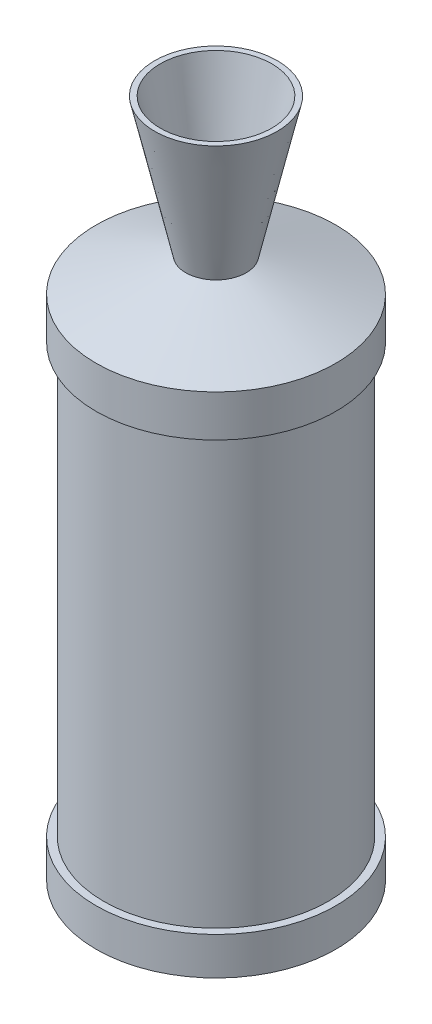
ISO-10303-21;
HEADER;
FILE_DESCRIPTION(('STEP AP214'),'2;1');
FILE_NAME('part.step','',(''),(''),'','','');
FILE_SCHEMA(('AUTOMOTIVE_DESIGN { 1 0 10303 214 1 1 1 1 }'));
ENDSEC;
DATA;
#1=APPLICATION_CONTEXT('core data for automotive mechanical design processes');
#2=APPLICATION_PROTOCOL_DEFINITION('international standard','automotive_design',2000,#1);
#3=PRODUCT_CONTEXT('',#1,'mechanical');
#4=PRODUCT('Part','Part','',(#3));
#5=PRODUCT_RELATED_PRODUCT_CATEGORY('part','',(#4));
#6=PRODUCT_DEFINITION_FORMATION('','',#4);
#7=PRODUCT_DEFINITION_CONTEXT('part definition',#1,'design');
#8=PRODUCT_DEFINITION('design','',#6,#7);
#9=PRODUCT_DEFINITION_SHAPE('','',#8);
#10=(LENGTH_UNIT() NAMED_UNIT(*) SI_UNIT(.MILLI.,.METRE.));
#11=(NAMED_UNIT(*) PLANE_ANGLE_UNIT() SI_UNIT($,.RADIAN.));
#12=(NAMED_UNIT(*) SI_UNIT($,.STERADIAN.) SOLID_ANGLE_UNIT());
#13=UNCERTAINTY_MEASURE_WITH_UNIT(LENGTH_MEASURE(1.E-05),#10,'distance_accuracy_value','');
#14=(GEOMETRIC_REPRESENTATION_CONTEXT(3) GLOBAL_UNCERTAINTY_ASSIGNED_CONTEXT((#13)) GLOBAL_UNIT_ASSIGNED_CONTEXT((#10,
#11,#12)) REPRESENTATION_CONTEXT('',''));
#15=CARTESIAN_POINT('',(0.,0.,0.));
#16=DIRECTION('',(0.,0.,1.));
#17=DIRECTION('',(1.,0.,0.));
#18=AXIS2_PLACEMENT_3D('',#15,#16,#17);
#19=CARTESIAN_POINT('',(0.,0.,0.));
#20=DIRECTION('',(0.,-1.,0.));
#21=DIRECTION('',(0.,0.,-1.));
#22=AXIS2_PLACEMENT_3D('',#19,#20,#21);
#23=CYLINDRICAL_SURFACE('',#22,6.35);
#24=CARTESIAN_POINT('',(0.,12.7,0.));
#25=DIRECTION('',(0.,-1.,0.));
#26=DIRECTION('',(0.,0.,-1.));
#27=AXIS2_PLACEMENT_3D('',#24,#25,#26);
#28=CIRCLE('',#27,6.35);
#29=CARTESIAN_POINT('',(0.,12.7,-6.35));
#30=VERTEX_POINT('',#29);
#31=EDGE_CURVE('E50',#30,#30,#28,.T.);
#32=ORIENTED_EDGE('',*,*,#31,.T.);
#33=EDGE_LOOP('',(#32));
#34=FACE_BOUND('',#33,.T.);
#35=CARTESIAN_POINT('',(0.,508.,0.));
#36=DIRECTION('',(0.,-1.,0.));
#37=DIRECTION('',(0.,0.,-1.));
#38=AXIS2_PLACEMENT_3D('',#35,#36,#37);
#39=CIRCLE('',#38,6.35);
#40=CARTESIAN_POINT('',(0.,508.,-6.35));
#41=VERTEX_POINT('',#40);
#42=EDGE_CURVE('E11',#41,#41,#39,.T.);
#43=ORIENTED_EDGE('',*,*,#42,.F.);
#44=EDGE_LOOP('',(#43));
#45=FACE_BOUND('',#44,.T.);
#46=ADVANCED_FACE('F36',(#34,#45),#23,.F.);
#47=CARTESIAN_POINT('',(0.,491.600448223911,0.));
#48=DIRECTION('',(0.,-1.,0.));
#49=DIRECTION('',(0.,0.,-1.));
#50=AXIS2_PLACEMENT_3D('',#47,#48,#49);
#51=CONICAL_SURFACE('',#50,95.3570367405145,1.38858978130618);
#52=ORIENTED_EDGE('',*,*,#42,.T.);
#53=EDGE_LOOP('',(#52));
#54=FACE_BOUND('',#53,.T.);
#55=CARTESIAN_POINT('',(0.,491.600448223911,0.));
#56=DIRECTION('',(0.,-1.,0.));
#57=DIRECTION('',(0.,0.,-1.));
#58=AXIS2_PLACEMENT_3D('',#55,#56,#57);
#59=CIRCLE('',#58,95.3570367405145);
#60=CARTESIAN_POINT('',(0.,491.600448223911,-95.3570367405145));
#61=VERTEX_POINT('',#60);
#62=EDGE_CURVE('E42',#61,#61,#59,.T.);
#63=ORIENTED_EDGE('',*,*,#62,.F.);
#64=EDGE_LOOP('',(#63));
#65=FACE_BOUND('',#64,.T.);
#66=ADVANCED_FACE('F66',(#54,#65),#51,.T.);
#67=CARTESIAN_POINT('',(0.,0.,0.));
#68=DIRECTION('',(0.,-1.,0.));
#69=DIRECTION('',(0.,0.,-1.));
#70=AXIS2_PLACEMENT_3D('',#67,#68,#69);
#71=CYLINDRICAL_SURFACE('',#70,95.3570367405145);
#72=ORIENTED_EDGE('',*,*,#62,.T.);
#73=EDGE_LOOP('',(#72));
#74=FACE_BOUND('',#73,.T.);
#75=CARTESIAN_POINT('',(0.,42.6531167765359,0.));
#76=DIRECTION('',(0.,-1.,0.));
#77=DIRECTION('',(0.,0.,-1.));
#78=AXIS2_PLACEMENT_3D('',#75,#76,#77);
#79=CIRCLE('',#78,95.3570367405145);
#80=CARTESIAN_POINT('',(0.,42.6531167765359,-95.3570367405145));
#81=VERTEX_POINT('',#80);
#82=EDGE_CURVE('E46',#81,#81,#79,.T.);
#83=ORIENTED_EDGE('',*,*,#82,.F.);
#84=EDGE_LOOP('',(#83));
#85=FACE_BOUND('',#84,.T.);
#86=ADVANCED_FACE('F60',(#74,#85),#71,.T.);
#87=CARTESIAN_POINT('',(0.,12.7,0.));
#88=DIRECTION('',(0.,1.,0.));
#89=DIRECTION('',(0.,0.,1.));
#90=AXIS2_PLACEMENT_3D('',#87,#88,#89);
#91=CONICAL_SURFACE('',#90,6.35,1.24617578850237);
#92=ORIENTED_EDGE('',*,*,#82,.T.);
#93=EDGE_LOOP('',(#92));
#94=FACE_BOUND('',#93,.T.);
#95=ORIENTED_EDGE('',*,*,#31,.F.);
#96=EDGE_LOOP('',(#95));
#97=FACE_BOUND('',#96,.T.);
#98=ADVANCED_FACE('F58',(#94,#97),#91,.T.);
#99=CLOSED_SHELL('',(#46,#66,#86,#98));
#100=MANIFOLD_SOLID_BREP('B2',#99);
#101=CARTESIAN_POINT('',(0.,4.,0.));
#102=DIRECTION('',(0.,1.,0.));
#103=DIRECTION('',(0.,0.,1.));
#104=AXIS2_PLACEMENT_3D('',#101,#102,#103);
#105=PLANE('',#104);
#106=CARTESIAN_POINT('',(0.,4.,0.));
#107=DIRECTION('',(0.,-1.,0.));
#108=DIRECTION('',(0.,0.,-1.));
#109=AXIS2_PLACEMENT_3D('',#106,#107,#108);
#110=CIRCLE('',#109,19.);
#111=CARTESIAN_POINT('',(0.,4.,-19.));
#112=VERTEX_POINT('',#111);
#113=EDGE_CURVE('E35',#112,#112,#110,.T.);
#114=ORIENTED_EDGE('',*,*,#113,.F.);
#115=EDGE_LOOP('',(#114));
#116=FACE_BOUND('',#115,.T.);
#117=ADVANCED_FACE('F97',(#116),#105,.T.);
#118=CARTESIAN_POINT('',(0.,34.44,0.));
#119=DIRECTION('',(0.,1.,0.));
#120=DIRECTION('',(0.,0.,1.));
#121=AXIS2_PLACEMENT_3D('',#118,#119,#120);
#122=CONICAL_SURFACE('',#121,98.37,1.20457687651813);
#123=ORIENTED_EDGE('',*,*,#113,.T.);
#124=EDGE_LOOP('',(#123));
#125=FACE_BOUND('',#124,.T.);
#126=CARTESIAN_POINT('',(0.,34.44,0.));
#127=DIRECTION('',(0.,-1.,0.));
#128=DIRECTION('',(0.,0.,-1.));
#129=AXIS2_PLACEMENT_3D('',#126,#127,#128);
#130=CIRCLE('',#129,98.37);
#131=CARTESIAN_POINT('',(0.,34.44,-98.37));
#132=VERTEX_POINT('',#131);
#133=EDGE_CURVE('E103',#132,#132,#130,.T.);
#134=ORIENTED_EDGE('',*,*,#133,.F.);
#135=EDGE_LOOP('',(#134));
#136=FACE_BOUND('',#135,.T.);
#137=ADVANCED_FACE('F175',(#125,#136),#122,.F.);
#138=CARTESIAN_POINT('',(0.,0.,0.));
#139=DIRECTION('',(0.,-1.,0.));
#140=DIRECTION('',(0.,0.,-1.));
#141=AXIS2_PLACEMENT_3D('',#138,#139,#140);
#142=CYLINDRICAL_SURFACE('',#141,98.37);
#143=ORIENTED_EDGE('',*,*,#133,.T.);
#144=EDGE_LOOP('',(#143));
#145=FACE_BOUND('',#144,.T.);
#146=CARTESIAN_POINT('',(0.,497.22,0.));
#147=DIRECTION('',(0.,-1.,0.));
#148=DIRECTION('',(0.,0.,-1.));
#149=AXIS2_PLACEMENT_3D('',#146,#147,#148);
#150=CIRCLE('',#149,98.37);
#151=CARTESIAN_POINT('',(0.,497.22,-98.37));
#152=VERTEX_POINT('',#151);
#153=EDGE_CURVE('E107',#152,#152,#150,.T.);
#154=ORIENTED_EDGE('',*,*,#153,.F.);
#155=EDGE_LOOP('',(#154));
#156=FACE_BOUND('',#155,.T.);
#157=ADVANCED_FACE('F180',(#145,#156),#142,.F.);
#158=CARTESIAN_POINT('',(0.,508.928258206574,0.));
#159=DIRECTION('',(0.,-1.,0.));
#160=DIRECTION('',(0.,0.,-1.));
#161=AXIS2_PLACEMENT_3D('',#158,#159,#160);
#162=CONICAL_SURFACE('',#161,67.0115032597108,1.21345724627848);
#163=ORIENTED_EDGE('',*,*,#153,.T.);
#164=EDGE_LOOP('',(#163));
#165=FACE_BOUND('',#164,.T.);
#166=CARTESIAN_POINT('',(0.,508.928258206574,0.));
#167=DIRECTION('',(0.,-1.,0.));
#168=DIRECTION('',(0.,0.,-1.));
#169=AXIS2_PLACEMENT_3D('',#166,#167,#168);
#170=CIRCLE('',#169,67.0115032597108);
#171=CARTESIAN_POINT('',(0.,508.928258206574,-67.0115032597108));
#172=VERTEX_POINT('',#171);
#173=EDGE_CURVE('E111',#172,#172,#170,.T.);
#174=ORIENTED_EDGE('',*,*,#173,.F.);
#175=EDGE_LOOP('',(#174));
#176=FACE_BOUND('',#175,.T.);
#177=ADVANCED_FACE('F184',(#165,#176),#162,.F.);
#178=CARTESIAN_POINT('',(0.,471.703452731778,0.));
#179=DIRECTION('',(0.,-1.,0.));
#180=DIRECTION('',(0.,0.,-1.));
#181=AXIS2_PLACEMENT_3D('',#178,#179,#180);
#182=TOROIDAL_SURFACE('',#181,52.3720409279304,40.);
#183=ORIENTED_EDGE('',*,*,#173,.T.);
#184=EDGE_LOOP('',(#183));
#185=FACE_BOUND('',#184,.T.);
#186=CARTESIAN_POINT('',(0.,509.121150910593,0.));
#187=DIRECTION('',(0.,-1.,0.));
#188=DIRECTION('',(0.,0.,-1.));
#189=AXIS2_PLACEMENT_3D('',#186,#187,#188);
#190=CIRCLE('',#189,38.2328803093102);
#191=CARTESIAN_POINT('',(0.,509.121150910593,-38.2328803093102));
#192=VERTEX_POINT('',#191);
#193=EDGE_CURVE('E116',#192,#192,#190,.T.);
#194=ORIENTED_EDGE('',*,*,#193,.F.);
#195=EDGE_LOOP('',(#194));
#196=FACE_BOUND('',#195,.T.);
#197=ADVANCED_FACE('F190',(#185,#196),#182,.F.);
#198=CARTESIAN_POINT('',(0.,527.83,0.));
#199=DIRECTION('',(0.,-1.,0.));
#200=DIRECTION('',(0.,0.,-1.));
#201=AXIS2_PLACEMENT_3D('',#198,#199,#200);
#202=TOROIDAL_SURFACE('',#201,31.1633,20.0000000000001);
#203=ORIENTED_EDGE('',*,*,#193,.T.);
#204=EDGE_LOOP('',(#203));
#205=FACE_BOUND('',#204,.T.);
#206=CARTESIAN_POINT('',(0.,543.15088886238,0.));
#207=DIRECTION('',(0.,-1.,0.));
#208=DIRECTION('',(0.,0.,-1.));
#209=AXIS2_PLACEMENT_3D('',#206,#207,#208);
#210=CIRCLE('',#209,18.3075478062691);
#211=CARTESIAN_POINT('',(0.,543.15088886238,-18.3075478062691));
#212=VERTEX_POINT('',#211);
#213=EDGE_CURVE('E119',#212,#212,#210,.T.);
#214=ORIENTED_EDGE('',*,*,#213,.F.);
#215=EDGE_LOOP('',(#214));
#216=FACE_BOUND('',#215,.T.);
#217=ADVANCED_FACE('F194',(#205,#216),#202,.T.);
#218=CARTESIAN_POINT('',(0.,573.792666587139,0.));
#219=DIRECTION('',(0.,-1.,0.));
#220=DIRECTION('',(0.,0.,-1.));
#221=AXIS2_PLACEMENT_3D('',#218,#219,#220);
#222=DEGENERATE_TOROIDAL_SURFACE('',#221,7.40395658119258,40.,.F.);
#223=ORIENTED_EDGE('',*,*,#213,.T.);
#224=EDGE_LOOP('',(#223));
#225=FACE_BOUND('',#224,.T.);
#226=CARTESIAN_POINT('',(0.,565.011883614733,0.));
#227=DIRECTION('',(0.,-1.,0.));
#228=DIRECTION('',(0.,0.,-1.));
#229=AXIS2_PLACEMENT_3D('',#226,#227,#228);
#230=CIRCLE('',#229,31.6203672488435);
#231=CARTESIAN_POINT('',(0.,565.011883614733,-31.6203672488435));
#232=VERTEX_POINT('',#231);
#233=EDGE_CURVE('E122',#232,#232,#230,.T.);
#234=ORIENTED_EDGE('',*,*,#233,.F.);
#235=EDGE_LOOP('',(#234));
#236=FACE_BOUND('',#235,.T.);
#237=ADVANCED_FACE('F198',(#225,#236),#222,.T.);
#238=CARTESIAN_POINT('',(0.,653.67,0.));
#239=DIRECTION('',(0.,1.,0.));
#240=DIRECTION('',(0.,0.,1.));
#241=AXIS2_PLACEMENT_3D('',#238,#239,#240);
#242=CONICAL_SURFACE('',#241,50.87,0.213803573638157);
#243=ORIENTED_EDGE('',*,*,#233,.T.);
#244=EDGE_LOOP('',(#243));
#245=FACE_BOUND('',#244,.T.);
#246=CARTESIAN_POINT('',(0.,653.67,0.));
#247=DIRECTION('',(0.,-1.,0.));
#248=DIRECTION('',(0.,0.,-1.));
#249=AXIS2_PLACEMENT_3D('',#246,#247,#248);
#250=CIRCLE('',#249,50.87);
#251=CARTESIAN_POINT('',(0.,653.67,-50.87));
#252=VERTEX_POINT('',#251);
#253=EDGE_CURVE('E125',#252,#252,#250,.T.);
#254=ORIENTED_EDGE('',*,*,#253,.F.);
#255=EDGE_LOOP('',(#254));
#256=FACE_BOUND('',#255,.T.);
#257=ADVANCED_FACE('F202',(#245,#256),#242,.F.);
#258=CARTESIAN_POINT('',(50.87,653.67,0.));
#259=DIRECTION('',(0.,1.,0.));
#260=DIRECTION('',(0.,0.,1.));
#261=AXIS2_PLACEMENT_3D('',#258,#259,#260);
#262=PLANE('',#261);
#263=ORIENTED_EDGE('',*,*,#253,.T.);
#264=EDGE_LOOP('',(#263));
#265=FACE_BOUND('',#264,.T.);
#266=CARTESIAN_POINT('',(0.,653.67,0.));
#267=DIRECTION('',(0.,-1.,0.));
#268=DIRECTION('',(0.,0.,-1.));
#269=AXIS2_PLACEMENT_3D('',#266,#267,#268);
#270=CIRCLE('',#269,55.87);
#271=CARTESIAN_POINT('',(0.,653.67,-55.87));
#272=VERTEX_POINT('',#271);
#273=EDGE_CURVE('E128',#272,#272,#270,.T.);
#274=ORIENTED_EDGE('',*,*,#273,.F.);
#275=EDGE_LOOP('',(#274));
#276=FACE_BOUND('',#275,.T.);
#277=ADVANCED_FACE('F206',(#265,#276),#262,.T.);
#278=CARTESIAN_POINT('',(0.,527.83,0.));
#279=DIRECTION('',(0.,1.,0.));
#280=DIRECTION('',(0.,0.,1.));
#281=AXIS2_PLACEMENT_3D('',#278,#279,#280);
#282=CONICAL_SURFACE('',#281,27.555,0.221322006022111);
#283=ORIENTED_EDGE('',*,*,#273,.T.);
#284=EDGE_LOOP('',(#283));
#285=FACE_BOUND('',#284,.T.);
#286=CARTESIAN_POINT('',(0.,527.83,0.));
#287=DIRECTION('',(0.,-1.,0.));
#288=DIRECTION('',(0.,0.,-1.));
#289=AXIS2_PLACEMENT_3D('',#286,#287,#288);
#290=CIRCLE('',#289,27.555);
#291=CARTESIAN_POINT('',(0.,527.83,-27.555));
#292=VERTEX_POINT('',#291);
#293=EDGE_CURVE('E131',#292,#292,#290,.T.);
#294=ORIENTED_EDGE('',*,*,#293,.F.);
#295=EDGE_LOOP('',(#294));
#296=FACE_BOUND('',#295,.T.);
#297=ADVANCED_FACE('F210',(#285,#296),#282,.T.);
#298=CARTESIAN_POINT('',(0.,497.22,0.));
#299=DIRECTION('',(0.,-1.,0.));
#300=DIRECTION('',(0.,0.,-1.));
#301=AXIS2_PLACEMENT_3D('',#298,#299,#300);
#302=CONICAL_SURFACE('',#301,109.297,1.21248960899088);
#303=ORIENTED_EDGE('',*,*,#293,.T.);
#304=EDGE_LOOP('',(#303));
#305=FACE_BOUND('',#304,.T.);
#306=CARTESIAN_POINT('',(0.,497.22,0.));
#307=DIRECTION('',(0.,-1.,0.));
#308=DIRECTION('',(0.,0.,-1.));
#309=AXIS2_PLACEMENT_3D('',#306,#307,#308);
#310=CIRCLE('',#309,109.297);
#311=CARTESIAN_POINT('',(0.,497.22,-109.297));
#312=VERTEX_POINT('',#311);
#313=EDGE_CURVE('E134',#312,#312,#310,.T.);
#314=ORIENTED_EDGE('',*,*,#313,.F.);
#315=EDGE_LOOP('',(#314));
#316=FACE_BOUND('',#315,.T.);
#317=ADVANCED_FACE('F214',(#305,#316),#302,.T.);
#318=CARTESIAN_POINT('',(0.,0.,0.));
#319=DIRECTION('',(0.,-1.,0.));
#320=DIRECTION('',(0.,0.,-1.));
#321=AXIS2_PLACEMENT_3D('',#318,#319,#320);
#322=CYLINDRICAL_SURFACE('',#321,109.297);
#323=ORIENTED_EDGE('',*,*,#313,.T.);
#324=EDGE_LOOP('',(#323));
#325=FACE_BOUND('',#324,.T.);
#326=CARTESIAN_POINT('',(0.,459.22,0.));
#327=DIRECTION('',(0.,-1.,0.));
#328=DIRECTION('',(0.,0.,-1.));
#329=AXIS2_PLACEMENT_3D('',#326,#327,#328);
#330=CIRCLE('',#329,109.297);
#331=CARTESIAN_POINT('',(0.,459.22,-109.297));
#332=VERTEX_POINT('',#331);
#333=EDGE_CURVE('E137',#332,#332,#330,.T.);
#334=ORIENTED_EDGE('',*,*,#333,.F.);
#335=EDGE_LOOP('',(#334));
#336=FACE_BOUND('',#335,.T.);
#337=ADVANCED_FACE('F218',(#325,#336),#322,.T.);
#338=CARTESIAN_POINT('',(102.37,459.22,0.));
#339=DIRECTION('',(0.,-1.,0.));
#340=DIRECTION('',(0.,0.,-1.));
#341=AXIS2_PLACEMENT_3D('',#338,#339,#340);
#342=PLANE('',#341);
#343=ORIENTED_EDGE('',*,*,#333,.T.);
#344=EDGE_LOOP('',(#343));
#345=FACE_BOUND('',#344,.T.);
#346=CARTESIAN_POINT('',(0.,459.22,0.));
#347=DIRECTION('',(0.,-1.,0.));
#348=DIRECTION('',(0.,0.,-1.));
#349=AXIS2_PLACEMENT_3D('',#346,#347,#348);
#350=CIRCLE('',#349,102.37);
#351=CARTESIAN_POINT('',(0.,459.22,-102.37));
#352=VERTEX_POINT('',#351);
#353=EDGE_CURVE('E140',#352,#352,#350,.T.);
#354=ORIENTED_EDGE('',*,*,#353,.F.);
#355=EDGE_LOOP('',(#354));
#356=FACE_BOUND('',#355,.T.);
#357=ADVANCED_FACE('F222',(#345,#356),#342,.T.);
#358=CARTESIAN_POINT('',(0.,0.,0.));
#359=DIRECTION('',(0.,-1.,0.));
#360=DIRECTION('',(0.,0.,-1.));
#361=AXIS2_PLACEMENT_3D('',#358,#359,#360);
#362=CYLINDRICAL_SURFACE('',#361,102.37);
#363=ORIENTED_EDGE('',*,*,#353,.T.);
#364=EDGE_LOOP('',(#363));
#365=FACE_BOUND('',#364,.T.);
#366=CARTESIAN_POINT('',(0.,68.84,0.));
#367=DIRECTION('',(0.,-1.,0.));
#368=DIRECTION('',(0.,0.,-1.));
#369=AXIS2_PLACEMENT_3D('',#366,#367,#368);
#370=CIRCLE('',#369,102.37);
#371=CARTESIAN_POINT('',(0.,68.84,-102.37));
#372=VERTEX_POINT('',#371);
#373=EDGE_CURVE('E143',#372,#372,#370,.T.);
#374=ORIENTED_EDGE('',*,*,#373,.F.);
#375=EDGE_LOOP('',(#374));
#376=FACE_BOUND('',#375,.T.);
#377=ADVANCED_FACE('F226',(#365,#376),#362,.T.);
#378=CARTESIAN_POINT('',(109.297,68.84,0.));
#379=DIRECTION('',(0.,1.,0.));
#380=DIRECTION('',(0.,0.,1.));
#381=AXIS2_PLACEMENT_3D('',#378,#379,#380);
#382=PLANE('',#381);
#383=ORIENTED_EDGE('',*,*,#373,.T.);
#384=EDGE_LOOP('',(#383));
#385=FACE_BOUND('',#384,.T.);
#386=CARTESIAN_POINT('',(0.,68.84,0.));
#387=DIRECTION('',(0.,-1.,0.));
#388=DIRECTION('',(0.,0.,-1.));
#389=AXIS2_PLACEMENT_3D('',#386,#387,#388);
#390=CIRCLE('',#389,109.297);
#391=CARTESIAN_POINT('',(0.,68.84,-109.297));
#392=VERTEX_POINT('',#391);
#393=EDGE_CURVE('E146',#392,#392,#390,.T.);
#394=ORIENTED_EDGE('',*,*,#393,.F.);
#395=EDGE_LOOP('',(#394));
#396=FACE_BOUND('',#395,.T.);
#397=ADVANCED_FACE('F230',(#385,#396),#382,.T.);
#398=CARTESIAN_POINT('',(0.,0.,0.));
#399=DIRECTION('',(0.,-1.,0.));
#400=DIRECTION('',(0.,0.,-1.));
#401=AXIS2_PLACEMENT_3D('',#398,#399,#400);
#402=CYLINDRICAL_SURFACE('',#401,109.297);
#403=ORIENTED_EDGE('',*,*,#393,.T.);
#404=EDGE_LOOP('',(#403));
#405=FACE_BOUND('',#404,.T.);
#406=CARTESIAN_POINT('',(0.,34.44,0.));
#407=DIRECTION('',(0.,-1.,0.));
#408=DIRECTION('',(0.,0.,-1.));
#409=AXIS2_PLACEMENT_3D('',#406,#407,#408);
#410=CIRCLE('',#409,109.297);
#411=CARTESIAN_POINT('',(0.,34.44,-109.297));
#412=VERTEX_POINT('',#411);
#413=EDGE_CURVE('E149',#412,#412,#410,.T.);
#414=ORIENTED_EDGE('',*,*,#413,.F.);
#415=EDGE_LOOP('',(#414));
#416=FACE_BOUND('',#415,.T.);
#417=ADVANCED_FACE('F171',(#405,#416),#402,.T.);
#418=CARTESIAN_POINT('',(102.37,34.44,0.));
#419=DIRECTION('',(0.,-1.,0.));
#420=DIRECTION('',(0.,0.,-1.));
#421=AXIS2_PLACEMENT_3D('',#418,#419,#420);
#422=PLANE('',#421);
#423=ORIENTED_EDGE('',*,*,#413,.T.);
#424=EDGE_LOOP('',(#423));
#425=FACE_BOUND('',#424,.T.);
#426=CARTESIAN_POINT('',(0.,34.44,0.));
#427=DIRECTION('',(0.,-1.,0.));
#428=DIRECTION('',(0.,0.,-1.));
#429=AXIS2_PLACEMENT_3D('',#426,#427,#428);
#430=CIRCLE('',#429,102.37);
#431=CARTESIAN_POINT('',(0.,34.44,-102.37));
#432=VERTEX_POINT('',#431);
#433=EDGE_CURVE('E152',#432,#432,#430,.T.);
#434=ORIENTED_EDGE('',*,*,#433,.F.);
#435=EDGE_LOOP('',(#434));
#436=FACE_BOUND('',#435,.T.);
#437=ADVANCED_FACE('F163',(#425,#436),#422,.T.);
#438=CARTESIAN_POINT('',(0.,0.,0.));
#439=DIRECTION('',(0.,1.,0.));
#440=DIRECTION('',(0.,0.,1.));
#441=AXIS2_PLACEMENT_3D('',#438,#439,#440);
#442=CONICAL_SURFACE('',#441,19.,1.17904961029698);
#443=ORIENTED_EDGE('',*,*,#433,.T.);
#444=EDGE_LOOP('',(#443));
#445=FACE_BOUND('',#444,.T.);
#446=CARTESIAN_POINT('',(0.,0.,0.));
#447=DIRECTION('',(0.,-1.,0.));
#448=DIRECTION('',(0.,0.,-1.));
#449=AXIS2_PLACEMENT_3D('',#446,#447,#448);
#450=CIRCLE('',#449,19.);
#451=CARTESIAN_POINT('',(0.,0.,-19.));
#452=VERTEX_POINT('',#451);
#453=EDGE_CURVE('E155',#452,#452,#450,.T.);
#454=ORIENTED_EDGE('',*,*,#453,.F.);
#455=EDGE_LOOP('',(#454));
#456=FACE_BOUND('',#455,.T.);
#457=ADVANCED_FACE('F161',(#445,#456),#442,.T.);
#458=CARTESIAN_POINT('',(0.,0.,0.));
#459=DIRECTION('',(0.,-1.,0.));
#460=DIRECTION('',(0.,0.,-1.));
#461=AXIS2_PLACEMENT_3D('',#458,#459,#460);
#462=PLANE('',#461);
#463=ORIENTED_EDGE('',*,*,#453,.T.);
#464=EDGE_LOOP('',(#463));
#465=FACE_BOUND('',#464,.T.);
#466=ADVANCED_FACE('F159',(#465),#462,.T.);
#467=CLOSED_SHELL('',(#117,#137,#157,#177,#197,#217,#237,#257,#277,#297,#317,#337,#357,#377,
#397,#417,#437,#457,#466));
#468=MANIFOLD_SOLID_BREP('B6',#467);
#469=ADVANCED_BREP_SHAPE_REPRESENTATION('',(#18,#100,#468),#14);
#470=SHAPE_DEFINITION_REPRESENTATION(#9,#469);
ENDSEC;
END-ISO-10303-21;
